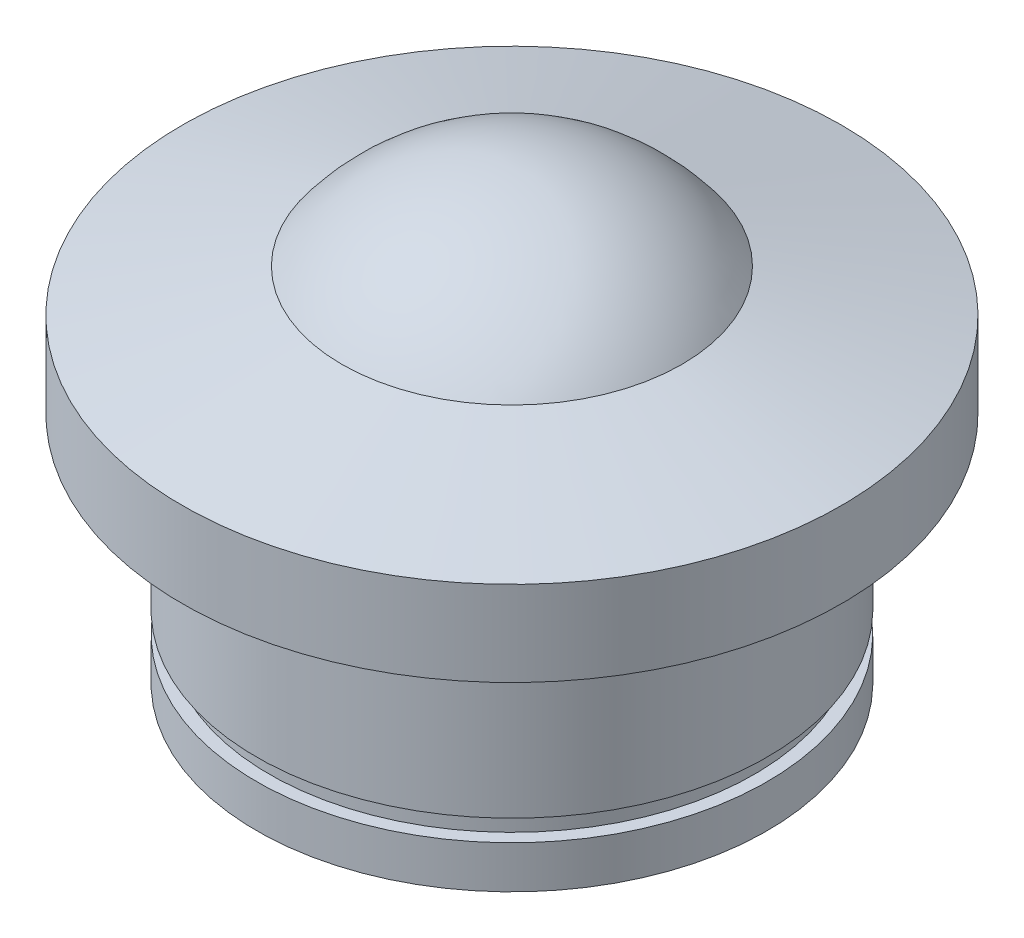
ISO-10303-21;
HEADER;
FILE_DESCRIPTION(('STEP AP214'),'2;1');
FILE_NAME('part.step','',(''),(''),'','','');
FILE_SCHEMA(('AUTOMOTIVE_DESIGN { 1 0 10303 214 1 1 1 1 }'));
ENDSEC;
DATA;
#1=APPLICATION_CONTEXT('core data for automotive mechanical design processes');
#2=APPLICATION_PROTOCOL_DEFINITION('international standard','automotive_design',2000,#1);
#3=PRODUCT_CONTEXT('',#1,'mechanical');
#4=PRODUCT('Part','Part','',(#3));
#5=PRODUCT_RELATED_PRODUCT_CATEGORY('part','',(#4));
#6=PRODUCT_DEFINITION_FORMATION('','',#4);
#7=PRODUCT_DEFINITION_CONTEXT('part definition',#1,'design');
#8=PRODUCT_DEFINITION('design','',#6,#7);
#9=PRODUCT_DEFINITION_SHAPE('','',#8);
#10=(LENGTH_UNIT() NAMED_UNIT(*) SI_UNIT(.MILLI.,.METRE.));
#11=(NAMED_UNIT(*) PLANE_ANGLE_UNIT() SI_UNIT($,.RADIAN.));
#12=(NAMED_UNIT(*) SI_UNIT($,.STERADIAN.) SOLID_ANGLE_UNIT());
#13=UNCERTAINTY_MEASURE_WITH_UNIT(LENGTH_MEASURE(1.E-05),#10,'distance_accuracy_value','');
#14=(GEOMETRIC_REPRESENTATION_CONTEXT(3) GLOBAL_UNCERTAINTY_ASSIGNED_CONTEXT((#13)) GLOBAL_UNIT_ASSIGNED_CONTEXT((#10,
#11,#12)) REPRESENTATION_CONTEXT('',''));
#15=CARTESIAN_POINT('',(0.,0.,0.));
#16=DIRECTION('',(0.,0.,1.));
#17=DIRECTION('',(1.,0.,0.));
#18=AXIS2_PLACEMENT_3D('',#15,#16,#17);
#19=CARTESIAN_POINT('',(0.,0.,0.));
#20=DIRECTION('',(0.,-1.,0.));
#21=DIRECTION('',(0.,0.,-1.));
#22=AXIS2_PLACEMENT_3D('',#19,#20,#21);
#23=PLANE('',#22);
#24=CARTESIAN_POINT('',(0.,0.,0.));
#25=DIRECTION('',(0.,-1.,0.));
#26=DIRECTION('',(0.,0.,-1.));
#27=AXIS2_PLACEMENT_3D('',#24,#25,#26);
#28=CIRCLE('',#27,12.);
#29=CARTESIAN_POINT('',(0.,0.,-12.));
#30=VERTEX_POINT('',#29);
#31=EDGE_CURVE('E10',#30,#30,#28,.T.);
#32=ORIENTED_EDGE('',*,*,#31,.T.);
#33=EDGE_LOOP('',(#32));
#34=FACE_BOUND('',#33,.T.);
#35=ADVANCED_FACE('F30',(#34),#23,.T.);
#36=CARTESIAN_POINT('',(0.,0.,0.));
#37=DIRECTION('',(0.,-1.,0.));
#38=DIRECTION('',(0.,0.,-1.));
#39=AXIS2_PLACEMENT_3D('',#36,#37,#38);
#40=CYLINDRICAL_SURFACE('',#39,12.);
#41=CARTESIAN_POINT('',(0.,2.,0.));
#42=DIRECTION('',(0.,-1.,0.));
#43=DIRECTION('',(0.,0.,-1.));
#44=AXIS2_PLACEMENT_3D('',#41,#42,#43);
#45=CIRCLE('',#44,12.);
#46=CARTESIAN_POINT('',(0.,2.,-12.));
#47=VERTEX_POINT('',#46);
#48=EDGE_CURVE('E36',#47,#47,#45,.T.);
#49=ORIENTED_EDGE('',*,*,#48,.T.);
#50=EDGE_LOOP('',(#49));
#51=FACE_BOUND('',#50,.T.);
#52=ORIENTED_EDGE('',*,*,#31,.F.);
#53=EDGE_LOOP('',(#52));
#54=FACE_BOUND('',#53,.T.);
#55=ADVANCED_FACE('F77',(#51,#54),#40,.T.);
#56=CARTESIAN_POINT('',(12.,2.,0.));
#57=DIRECTION('',(0.,1.,0.));
#58=DIRECTION('',(0.,0.,1.));
#59=AXIS2_PLACEMENT_3D('',#56,#57,#58);
#60=PLANE('',#59);
#61=CARTESIAN_POINT('',(0.,2.,0.));
#62=DIRECTION('',(0.,-1.,0.));
#63=DIRECTION('',(0.,0.,-1.));
#64=AXIS2_PLACEMENT_3D('',#61,#62,#63);
#65=CIRCLE('',#64,11.4);
#66=CARTESIAN_POINT('',(0.,2.,-11.4));
#67=VERTEX_POINT('',#66);
#68=EDGE_CURVE('E40',#67,#67,#65,.T.);
#69=ORIENTED_EDGE('',*,*,#68,.T.);
#70=EDGE_LOOP('',(#69));
#71=FACE_BOUND('',#70,.T.);
#72=ORIENTED_EDGE('',*,*,#48,.F.);
#73=EDGE_LOOP('',(#72));
#74=FACE_BOUND('',#73,.T.);
#75=ADVANCED_FACE('F81',(#71,#74),#60,.T.);
#76=CARTESIAN_POINT('',(0.,0.,0.));
#77=DIRECTION('',(0.,-1.,0.));
#78=DIRECTION('',(0.,0.,-1.));
#79=AXIS2_PLACEMENT_3D('',#76,#77,#78);
#80=CYLINDRICAL_SURFACE('',#79,11.4);
#81=CARTESIAN_POINT('',(0.,3.,0.));
#82=DIRECTION('',(0.,-1.,0.));
#83=DIRECTION('',(0.,0.,-1.));
#84=AXIS2_PLACEMENT_3D('',#81,#82,#83);
#85=CIRCLE('',#84,11.4);
#86=CARTESIAN_POINT('',(0.,3.,-11.4));
#87=VERTEX_POINT('',#86);
#88=EDGE_CURVE('E44',#87,#87,#85,.T.);
#89=ORIENTED_EDGE('',*,*,#88,.T.);
#90=EDGE_LOOP('',(#89));
#91=FACE_BOUND('',#90,.T.);
#92=ORIENTED_EDGE('',*,*,#68,.F.);
#93=EDGE_LOOP('',(#92));
#94=FACE_BOUND('',#93,.T.);
#95=ADVANCED_FACE('F85',(#91,#94),#80,.T.);
#96=CARTESIAN_POINT('',(11.4,3.,0.));
#97=DIRECTION('',(0.,-1.,0.));
#98=DIRECTION('',(0.,0.,-1.));
#99=AXIS2_PLACEMENT_3D('',#96,#97,#98);
#100=PLANE('',#99);
#101=CARTESIAN_POINT('',(0.,3.,0.));
#102=DIRECTION('',(0.,-1.,0.));
#103=DIRECTION('',(0.,0.,-1.));
#104=AXIS2_PLACEMENT_3D('',#101,#102,#103);
#105=CIRCLE('',#104,12.);
#106=CARTESIAN_POINT('',(0.,3.,-12.));
#107=VERTEX_POINT('',#106);
#108=EDGE_CURVE('E49',#107,#107,#105,.T.);
#109=ORIENTED_EDGE('',*,*,#108,.T.);
#110=EDGE_LOOP('',(#109));
#111=FACE_BOUND('',#110,.T.);
#112=ORIENTED_EDGE('',*,*,#88,.F.);
#113=EDGE_LOOP('',(#112));
#114=FACE_BOUND('',#113,.T.);
#115=ADVANCED_FACE('F92',(#111,#114),#100,.T.);
#116=CARTESIAN_POINT('',(0.,0.,0.));
#117=DIRECTION('',(0.,-1.,0.));
#118=DIRECTION('',(0.,0.,-1.));
#119=AXIS2_PLACEMENT_3D('',#116,#117,#118);
#120=CYLINDRICAL_SURFACE('',#119,12.);
#121=CARTESIAN_POINT('',(0.,11.,0.));
#122=DIRECTION('',(0.,-1.,0.));
#123=DIRECTION('',(0.,0.,-1.));
#124=AXIS2_PLACEMENT_3D('',#121,#122,#123);
#125=CIRCLE('',#124,12.);
#126=CARTESIAN_POINT('',(0.,11.,-12.));
#127=VERTEX_POINT('',#126);
#128=EDGE_CURVE('E52',#127,#127,#125,.T.);
#129=ORIENTED_EDGE('',*,*,#128,.T.);
#130=EDGE_LOOP('',(#129));
#131=FACE_BOUND('',#130,.T.);
#132=ORIENTED_EDGE('',*,*,#108,.F.);
#133=EDGE_LOOP('',(#132));
#134=FACE_BOUND('',#133,.T.);
#135=ADVANCED_FACE('F96',(#131,#134),#120,.T.);
#136=CARTESIAN_POINT('',(12.,11.,0.));
#137=DIRECTION('',(0.,-1.,0.));
#138=DIRECTION('',(0.,0.,-1.));
#139=AXIS2_PLACEMENT_3D('',#136,#137,#138);
#140=PLANE('',#139);
#141=CARTESIAN_POINT('',(0.,11.,0.));
#142=DIRECTION('',(0.,-1.,0.));
#143=DIRECTION('',(0.,0.,-1.));
#144=AXIS2_PLACEMENT_3D('',#141,#142,#143);
#145=CIRCLE('',#144,15.5);
#146=CARTESIAN_POINT('',(0.,11.,-15.5));
#147=VERTEX_POINT('',#146);
#148=EDGE_CURVE('E55',#147,#147,#145,.T.);
#149=ORIENTED_EDGE('',*,*,#148,.T.);
#150=EDGE_LOOP('',(#149));
#151=FACE_BOUND('',#150,.T.);
#152=ORIENTED_EDGE('',*,*,#128,.F.);
#153=EDGE_LOOP('',(#152));
#154=FACE_BOUND('',#153,.T.);
#155=ADVANCED_FACE('F100',(#151,#154),#140,.T.);
#156=CARTESIAN_POINT('',(0.,0.,0.));
#157=DIRECTION('',(0.,-1.,0.));
#158=DIRECTION('',(0.,0.,-1.));
#159=AXIS2_PLACEMENT_3D('',#156,#157,#158);
#160=CYLINDRICAL_SURFACE('',#159,15.5);
#161=CARTESIAN_POINT('',(0.,15.,0.));
#162=DIRECTION('',(0.,-1.,0.));
#163=DIRECTION('',(0.,0.,-1.));
#164=AXIS2_PLACEMENT_3D('',#161,#162,#163);
#165=CIRCLE('',#164,15.5);
#166=CARTESIAN_POINT('',(0.,15.,-15.5));
#167=VERTEX_POINT('',#166);
#168=EDGE_CURVE('E58',#167,#167,#165,.T.);
#169=ORIENTED_EDGE('',*,*,#168,.T.);
#170=EDGE_LOOP('',(#169));
#171=FACE_BOUND('',#170,.T.);
#172=ORIENTED_EDGE('',*,*,#148,.F.);
#173=EDGE_LOOP('',(#172));
#174=FACE_BOUND('',#173,.T.);
#175=ADVANCED_FACE('F74',(#171,#174),#160,.T.);
#176=CARTESIAN_POINT('',(0.,15.,0.));
#177=DIRECTION('',(0.,-1.,0.));
#178=DIRECTION('',(0.,0.,-1.));
#179=AXIS2_PLACEMENT_3D('',#176,#177,#178);
#180=CONICAL_SURFACE('',#179,15.5,1.31019393504756);
#181=CARTESIAN_POINT('',(0.,17.,0.));
#182=DIRECTION('',(0.,-1.,0.));
#183=DIRECTION('',(0.,0.,-1.));
#184=AXIS2_PLACEMENT_3D('',#181,#182,#183);
#185=CIRCLE('',#184,8.);
#186=CARTESIAN_POINT('',(0.,17.,-8.));
#187=VERTEX_POINT('',#186);
#188=EDGE_CURVE('E61',#187,#187,#185,.T.);
#189=ORIENTED_EDGE('',*,*,#188,.T.);
#190=EDGE_LOOP('',(#189));
#191=FACE_BOUND('',#190,.T.);
#192=ORIENTED_EDGE('',*,*,#168,.F.);
#193=EDGE_LOOP('',(#192));
#194=FACE_BOUND('',#193,.T.);
#195=ADVANCED_FACE('F65',(#191,#194),#180,.T.);
#196=CARTESIAN_POINT('',(0.,11.,0.));
#197=DIRECTION('',(0.,-1.,0.));
#198=DIRECTION('',(1.,0.,0.));
#199=AXIS2_PLACEMENT_3D('',#196,#197,#198);
#200=SPHERICAL_SURFACE('',#199,10.);
#201=ORIENTED_EDGE('',*,*,#188,.F.);
#202=EDGE_LOOP('',(#201));
#203=FACE_BOUND('',#202,.T.);
#204=ADVANCED_FACE('F68',(#203),#200,.T.);
#205=CLOSED_SHELL('',(#35,#55,#75,#95,#115,#135,#155,#175,#195,#204));
#206=MANIFOLD_SOLID_BREP('B2',#205);
#207=ADVANCED_BREP_SHAPE_REPRESENTATION('',(#18,#206),#14);
#208=SHAPE_DEFINITION_REPRESENTATION(#9,#207);
ENDSEC;
END-ISO-10303-21;
